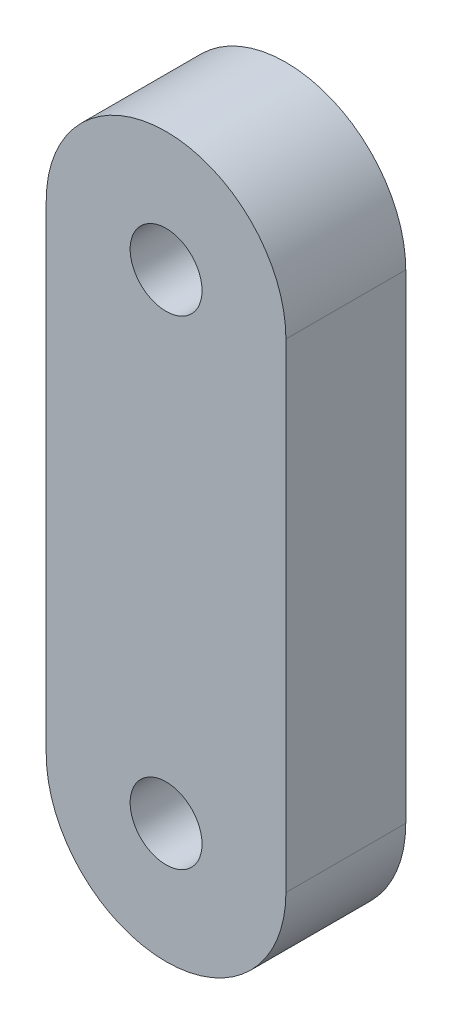
ISO-10303-21;
HEADER;
FILE_DESCRIPTION(('STEP AP214'),'2;1');
FILE_NAME('part.step','',(''),(''),'','','');
FILE_SCHEMA(('AUTOMOTIVE_DESIGN { 1 0 10303 214 1 1 1 1 }'));
ENDSEC;
DATA;
#1=APPLICATION_CONTEXT('core data for automotive mechanical design processes');
#2=APPLICATION_PROTOCOL_DEFINITION('international standard','automotive_design',2000,#1);
#3=PRODUCT_CONTEXT('',#1,'mechanical');
#4=PRODUCT('Part','Part','',(#3));
#5=PRODUCT_RELATED_PRODUCT_CATEGORY('part','',(#4));
#6=PRODUCT_DEFINITION_FORMATION('','',#4);
#7=PRODUCT_DEFINITION_CONTEXT('part definition',#1,'design');
#8=PRODUCT_DEFINITION('design','',#6,#7);
#9=PRODUCT_DEFINITION_SHAPE('','',#8);
#10=(LENGTH_UNIT() NAMED_UNIT(*) SI_UNIT(.MILLI.,.METRE.));
#11=(NAMED_UNIT(*) PLANE_ANGLE_UNIT() SI_UNIT($,.RADIAN.));
#12=(NAMED_UNIT(*) SI_UNIT($,.STERADIAN.) SOLID_ANGLE_UNIT());
#13=UNCERTAINTY_MEASURE_WITH_UNIT(LENGTH_MEASURE(1.E-05),#10,'distance_accuracy_value','');
#14=(GEOMETRIC_REPRESENTATION_CONTEXT(3) GLOBAL_UNCERTAINTY_ASSIGNED_CONTEXT((#13)) GLOBAL_UNIT_ASSIGNED_CONTEXT((#10,
#11,#12)) REPRESENTATION_CONTEXT('',''));
#15=CARTESIAN_POINT('',(0.,0.,0.));
#16=DIRECTION('',(0.,0.,1.));
#17=DIRECTION('',(1.,0.,0.));
#18=AXIS2_PLACEMENT_3D('',#15,#16,#17);
#19=CARTESIAN_POINT('',(0.,-2.,1.));
#20=DIRECTION('',(0.,0.,-1.));
#21=DIRECTION('',(-1.,0.,0.));
#22=AXIS2_PLACEMENT_3D('',#19,#20,#21);
#23=CYLINDRICAL_SURFACE('',#22,1.);
#24=CARTESIAN_POINT('',(0.,-2.,0.));
#25=DIRECTION('',(0.,0.,1.));
#26=DIRECTION('',(1.,0.,0.));
#27=AXIS2_PLACEMENT_3D('',#24,#25,#26);
#28=CIRCLE('',#27,1.);
#29=CARTESIAN_POINT('',(-1.,-2.,0.));
#30=VERTEX_POINT('',#29);
#31=CARTESIAN_POINT('',(1.,-2.,0.));
#32=VERTEX_POINT('',#31);
#33=EDGE_CURVE('E108',#30,#32,#28,.T.);
#34=ORIENTED_EDGE('',*,*,#33,.T.);
#35=DIRECTION('',(0.,0.,-1.));
#36=VECTOR('',#35,1.);
#37=CARTESIAN_POINT('',(1.,-2.,1.));
#38=LINE('',#37,#36);
#39=CARTESIAN_POINT('',(1.,-2.,1.));
#40=VERTEX_POINT('',#39);
#41=EDGE_CURVE('E11',#40,#32,#38,.T.);
#42=ORIENTED_EDGE('',*,*,#41,.F.);
#43=CARTESIAN_POINT('',(0.,-2.,1.));
#44=DIRECTION('',(0.,0.,1.));
#45=DIRECTION('',(1.,0.,0.));
#46=AXIS2_PLACEMENT_3D('',#43,#44,#45);
#47=CIRCLE('',#46,1.);
#48=CARTESIAN_POINT('',(-1.,-2.,1.));
#49=VERTEX_POINT('',#48);
#50=EDGE_CURVE('E79',#49,#40,#47,.T.);
#51=ORIENTED_EDGE('',*,*,#50,.F.);
#52=DIRECTION('',(0.,0.,-1.));
#53=VECTOR('',#52,1.);
#54=CARTESIAN_POINT('',(-1.,-2.,1.));
#55=LINE('',#54,#53);
#56=EDGE_CURVE('E107',#49,#30,#55,.T.);
#57=ORIENTED_EDGE('',*,*,#56,.T.);
#58=EDGE_LOOP('',(#34,#42,#51,#57));
#59=FACE_BOUND('',#58,.T.);
#60=ADVANCED_FACE('F37',(#59),#23,.T.);
#61=CARTESIAN_POINT('',(1.,0.,1.));
#62=DIRECTION('',(1.,0.,0.));
#63=DIRECTION('',(0.,0.,-1.));
#64=AXIS2_PLACEMENT_3D('',#61,#62,#63);
#65=PLANE('',#64);
#66=DIRECTION('',(0.,-1.,0.));
#67=VECTOR('',#66,1.);
#68=CARTESIAN_POINT('',(1.,0.,0.));
#69=LINE('',#68,#67);
#70=CARTESIAN_POINT('',(1.,2.,0.));
#71=VERTEX_POINT('',#70);
#72=EDGE_CURVE('E89',#71,#32,#69,.T.);
#73=ORIENTED_EDGE('',*,*,#72,.F.);
#74=DIRECTION('',(0.,0.,-1.));
#75=VECTOR('',#74,1.);
#76=CARTESIAN_POINT('',(1.,2.,1.));
#77=LINE('',#76,#75);
#78=CARTESIAN_POINT('',(1.,2.,1.));
#79=VERTEX_POINT('',#78);
#80=EDGE_CURVE('E45',#79,#71,#77,.T.);
#81=ORIENTED_EDGE('',*,*,#80,.F.);
#82=DIRECTION('',(0.,-1.,0.));
#83=VECTOR('',#82,1.);
#84=CARTESIAN_POINT('',(1.,0.,1.));
#85=LINE('',#84,#83);
#86=EDGE_CURVE('E87',#79,#40,#85,.T.);
#87=ORIENTED_EDGE('',*,*,#86,.T.);
#88=ORIENTED_EDGE('',*,*,#41,.T.);
#89=EDGE_LOOP('',(#73,#81,#87,#88));
#90=FACE_BOUND('',#89,.T.);
#91=ADVANCED_FACE('F86',(#90),#65,.T.);
#92=CARTESIAN_POINT('',(0.,2.,1.));
#93=DIRECTION('',(0.,0.,-1.));
#94=DIRECTION('',(-1.,0.,0.));
#95=AXIS2_PLACEMENT_3D('',#92,#93,#94);
#96=CYLINDRICAL_SURFACE('',#95,1.);
#97=CARTESIAN_POINT('',(0.,2.,0.));
#98=DIRECTION('',(0.,0.,1.));
#99=DIRECTION('',(1.,0.,0.));
#100=AXIS2_PLACEMENT_3D('',#97,#98,#99);
#101=CIRCLE('',#100,1.);
#102=CARTESIAN_POINT('',(-1.,2.,0.));
#103=VERTEX_POINT('',#102);
#104=EDGE_CURVE('E68',#71,#103,#101,.T.);
#105=ORIENTED_EDGE('',*,*,#104,.T.);
#106=DIRECTION('',(0.,0.,-1.));
#107=VECTOR('',#106,1.);
#108=CARTESIAN_POINT('',(-1.,2.,1.));
#109=LINE('',#108,#107);
#110=CARTESIAN_POINT('',(-1.,2.,1.));
#111=VERTEX_POINT('',#110);
#112=EDGE_CURVE('E90',#111,#103,#109,.T.);
#113=ORIENTED_EDGE('',*,*,#112,.F.);
#114=CARTESIAN_POINT('',(0.,2.,1.));
#115=DIRECTION('',(0.,0.,1.));
#116=DIRECTION('',(1.,0.,0.));
#117=AXIS2_PLACEMENT_3D('',#114,#115,#116);
#118=CIRCLE('',#117,1.);
#119=EDGE_CURVE('E91',#79,#111,#118,.T.);
#120=ORIENTED_EDGE('',*,*,#119,.F.);
#121=ORIENTED_EDGE('',*,*,#80,.T.);
#122=EDGE_LOOP('',(#105,#113,#120,#121));
#123=FACE_BOUND('',#122,.T.);
#124=ADVANCED_FACE('F92',(#123),#96,.T.);
#125=CARTESIAN_POINT('',(0.,-2.,1.));
#126=DIRECTION('',(0.,0.,-1.));
#127=DIRECTION('',(-1.,0.,0.));
#128=AXIS2_PLACEMENT_3D('',#125,#126,#127);
#129=CYLINDRICAL_SURFACE('',#128,0.3);
#130=CARTESIAN_POINT('',(0.,-2.,1.));
#131=DIRECTION('',(0.,0.,1.));
#132=DIRECTION('',(1.,0.,0.));
#133=AXIS2_PLACEMENT_3D('',#130,#131,#132);
#134=CIRCLE('',#133,0.3);
#135=CARTESIAN_POINT('',(0.3,-2.,1.));
#136=VERTEX_POINT('',#135);
#137=EDGE_CURVE('E101',#136,#136,#134,.T.);
#138=ORIENTED_EDGE('',*,*,#137,.T.);
#139=EDGE_LOOP('',(#138));
#140=FACE_BOUND('',#139,.T.);
#141=CARTESIAN_POINT('',(0.,-2.,0.));
#142=DIRECTION('',(0.,0.,1.));
#143=DIRECTION('',(1.,0.,0.));
#144=AXIS2_PLACEMENT_3D('',#141,#142,#143);
#145=CIRCLE('',#144,0.3);
#146=CARTESIAN_POINT('',(0.3,-2.,0.));
#147=VERTEX_POINT('',#146);
#148=EDGE_CURVE('E114',#147,#147,#145,.T.);
#149=ORIENTED_EDGE('',*,*,#148,.F.);
#150=EDGE_LOOP('',(#149));
#151=FACE_BOUND('',#150,.T.);
#152=ADVANCED_FACE('F133',(#140,#151),#129,.F.);
#153=CARTESIAN_POINT('',(-1.,0.,1.));
#154=DIRECTION('',(1.,0.,0.));
#155=DIRECTION('',(0.,0.,-1.));
#156=AXIS2_PLACEMENT_3D('',#153,#154,#155);
#157=PLANE('',#156);
#158=DIRECTION('',(0.,-1.,0.));
#159=VECTOR('',#158,1.);
#160=CARTESIAN_POINT('',(-1.,0.,0.));
#161=LINE('',#160,#159);
#162=EDGE_CURVE('E74',#103,#30,#161,.T.);
#163=ORIENTED_EDGE('',*,*,#162,.T.);
#164=ORIENTED_EDGE('',*,*,#56,.F.);
#165=DIRECTION('',(0.,-1.,0.));
#166=VECTOR('',#165,1.);
#167=CARTESIAN_POINT('',(-1.,0.,1.));
#168=LINE('',#167,#166);
#169=EDGE_CURVE('E53',#111,#49,#168,.T.);
#170=ORIENTED_EDGE('',*,*,#169,.F.);
#171=ORIENTED_EDGE('',*,*,#112,.T.);
#172=EDGE_LOOP('',(#163,#164,#170,#171));
#173=FACE_BOUND('',#172,.T.);
#174=ADVANCED_FACE('F120',(#173),#157,.F.);
#175=CARTESIAN_POINT('',(0.,2.,1.));
#176=DIRECTION('',(0.,0.,-1.));
#177=DIRECTION('',(-1.,0.,0.));
#178=AXIS2_PLACEMENT_3D('',#175,#176,#177);
#179=CYLINDRICAL_SURFACE('',#178,0.3);
#180=CARTESIAN_POINT('',(0.,2.,1.));
#181=DIRECTION('',(0.,0.,1.));
#182=DIRECTION('',(1.,0.,0.));
#183=AXIS2_PLACEMENT_3D('',#180,#181,#182);
#184=CIRCLE('',#183,0.3);
#185=CARTESIAN_POINT('',(0.3,2.,1.));
#186=VERTEX_POINT('',#185);
#187=EDGE_CURVE('E104',#186,#186,#184,.T.);
#188=ORIENTED_EDGE('',*,*,#187,.T.);
#189=EDGE_LOOP('',(#188));
#190=FACE_BOUND('',#189,.T.);
#191=CARTESIAN_POINT('',(0.,2.,0.));
#192=DIRECTION('',(0.,0.,1.));
#193=DIRECTION('',(1.,0.,0.));
#194=AXIS2_PLACEMENT_3D('',#191,#192,#193);
#195=CIRCLE('',#194,0.3);
#196=CARTESIAN_POINT('',(0.3,2.,0.));
#197=VERTEX_POINT('',#196);
#198=EDGE_CURVE('E97',#197,#197,#195,.T.);
#199=ORIENTED_EDGE('',*,*,#198,.F.);
#200=EDGE_LOOP('',(#199));
#201=FACE_BOUND('',#200,.T.);
#202=ADVANCED_FACE('F138',(#190,#201),#179,.F.);
#203=CARTESIAN_POINT('',(0.,0.,1.));
#204=DIRECTION('',(0.,0.,1.));
#205=DIRECTION('',(1.,0.,0.));
#206=AXIS2_PLACEMENT_3D('',#203,#204,#205);
#207=PLANE('',#206);
#208=ORIENTED_EDGE('',*,*,#50,.T.);
#209=ORIENTED_EDGE('',*,*,#86,.F.);
#210=ORIENTED_EDGE('',*,*,#119,.T.);
#211=ORIENTED_EDGE('',*,*,#169,.T.);
#212=EDGE_LOOP('',(#208,#209,#210,#211));
#213=FACE_BOUND('',#212,.T.);
#214=ORIENTED_EDGE('',*,*,#137,.F.);
#215=EDGE_LOOP('',(#214));
#216=FACE_BOUND('',#215,.T.);
#217=ORIENTED_EDGE('',*,*,#187,.F.);
#218=EDGE_LOOP('',(#217));
#219=FACE_BOUND('',#218,.T.);
#220=ADVANCED_FACE('F94',(#213,#216,#219),#207,.T.);
#221=CARTESIAN_POINT('',(0.,0.,0.));
#222=DIRECTION('',(0.,0.,1.));
#223=DIRECTION('',(1.,0.,0.));
#224=AXIS2_PLACEMENT_3D('',#221,#222,#223);
#225=PLANE('',#224);
#226=ORIENTED_EDGE('',*,*,#33,.F.);
#227=ORIENTED_EDGE('',*,*,#162,.F.);
#228=ORIENTED_EDGE('',*,*,#104,.F.);
#229=ORIENTED_EDGE('',*,*,#72,.T.);
#230=EDGE_LOOP('',(#226,#227,#228,#229));
#231=FACE_BOUND('',#230,.T.);
#232=ORIENTED_EDGE('',*,*,#148,.T.);
#233=EDGE_LOOP('',(#232));
#234=FACE_BOUND('',#233,.T.);
#235=ORIENTED_EDGE('',*,*,#198,.T.);
#236=EDGE_LOOP('',(#235));
#237=FACE_BOUND('',#236,.T.);
#238=ADVANCED_FACE('F123',(#231,#234,#237),#225,.F.);
#239=CLOSED_SHELL('',(#60,#91,#124,#152,#174,#202,#220,#238));
#240=MANIFOLD_SOLID_BREP('B2',#239);
#241=ADVANCED_BREP_SHAPE_REPRESENTATION('',(#18,#240),#14);
#242=SHAPE_DEFINITION_REPRESENTATION(#9,#241);
ENDSEC;
END-ISO-10303-21;
